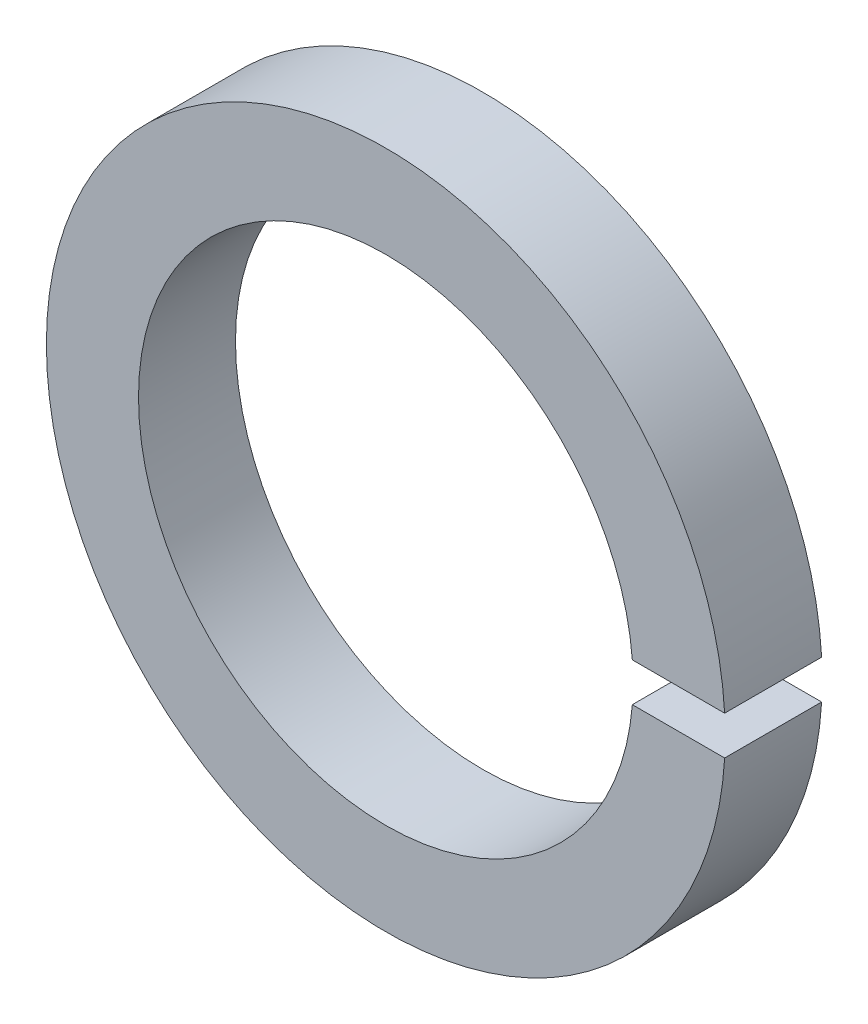
ISO-10303-21;
HEADER;
FILE_DESCRIPTION(('STEP AP214'),'2;1');
FILE_NAME('part.step','',(''),(''),'','','');
FILE_SCHEMA(('AUTOMOTIVE_DESIGN { 1 0 10303 214 1 1 1 1 }'));
ENDSEC;
DATA;
#1=APPLICATION_CONTEXT('core data for automotive mechanical design processes');
#2=APPLICATION_PROTOCOL_DEFINITION('international standard','automotive_design',2000,#1);
#3=PRODUCT_CONTEXT('',#1,'mechanical');
#4=PRODUCT('Part','Part','',(#3));
#5=PRODUCT_RELATED_PRODUCT_CATEGORY('part','',(#4));
#6=PRODUCT_DEFINITION_FORMATION('','',#4);
#7=PRODUCT_DEFINITION_CONTEXT('part definition',#1,'design');
#8=PRODUCT_DEFINITION('design','',#6,#7);
#9=PRODUCT_DEFINITION_SHAPE('','',#8);
#10=(LENGTH_UNIT() NAMED_UNIT(*) SI_UNIT(.MILLI.,.METRE.));
#11=(NAMED_UNIT(*) PLANE_ANGLE_UNIT() SI_UNIT($,.RADIAN.));
#12=(NAMED_UNIT(*) SI_UNIT($,.STERADIAN.) SOLID_ANGLE_UNIT());
#13=UNCERTAINTY_MEASURE_WITH_UNIT(LENGTH_MEASURE(1.E-05),#10,'distance_accuracy_value','');
#14=(GEOMETRIC_REPRESENTATION_CONTEXT(3) GLOBAL_UNCERTAINTY_ASSIGNED_CONTEXT((#13)) GLOBAL_UNIT_ASSIGNED_CONTEXT((#10,
#11,#12)) REPRESENTATION_CONTEXT('',''));
#15=CARTESIAN_POINT('',(0.,0.,0.));
#16=DIRECTION('',(0.,0.,1.));
#17=DIRECTION('',(1.,0.,0.));
#18=AXIS2_PLACEMENT_3D('',#15,#16,#17);
#19=CARTESIAN_POINT('',(0.,0.,0.));
#20=DIRECTION('',(0.,0.,1.));
#21=DIRECTION('',(1.,0.,0.));
#22=AXIS2_PLACEMENT_3D('',#19,#20,#21);
#23=PLANE('',#22);
#24=DIRECTION('',(1.,0.,0.));
#25=VECTOR('',#24,1.);
#26=CARTESIAN_POINT('',(0.,0.2,0.));
#27=LINE('',#26,#25);
#28=CARTESIAN_POINT('',(2.54214476377723,0.2,0.));
#29=VERTEX_POINT('',#28);
#30=CARTESIAN_POINT('',(3.49428104193123,0.2,0.));
#31=VERTEX_POINT('',#30);
#32=EDGE_CURVE('E63',#29,#31,#27,.T.);
#33=ORIENTED_EDGE('',*,*,#32,.F.);
#34=CARTESIAN_POINT('',(0.,0.,0.));
#35=DIRECTION('',(0.,0.,-1.));
#36=DIRECTION('',(-1.,0.,0.));
#37=AXIS2_PLACEMENT_3D('',#34,#35,#36);
#38=CIRCLE('',#37,2.55);
#39=CARTESIAN_POINT('',(2.54214476377723,-0.2,0.));
#40=VERTEX_POINT('',#39);
#41=EDGE_CURVE('E67',#29,#40,#38,.F.);
#42=ORIENTED_EDGE('',*,*,#41,.T.);
#43=DIRECTION('',(1.,0.,0.));
#44=VECTOR('',#43,1.);
#45=CARTESIAN_POINT('',(2.54214476377723,-0.2,0.));
#46=LINE('',#45,#44);
#47=CARTESIAN_POINT('',(3.49428104193123,-0.2,0.));
#48=VERTEX_POINT('',#47);
#49=EDGE_CURVE('E65',#40,#48,#46,.T.);
#50=ORIENTED_EDGE('',*,*,#49,.T.);
#51=CARTESIAN_POINT('',(0.,0.,0.));
#52=DIRECTION('',(0.,0.,-1.));
#53=DIRECTION('',(-1.,0.,0.));
#54=AXIS2_PLACEMENT_3D('',#51,#52,#53);
#55=CIRCLE('',#54,3.5);
#56=EDGE_CURVE('E19',#31,#48,#55,.F.);
#57=ORIENTED_EDGE('',*,*,#56,.F.);
#58=EDGE_LOOP('',(#33,#42,#50,#57));
#59=FACE_BOUND('',#58,.T.);
#60=ADVANCED_FACE('F16',(#59),#23,.F.);
#61=CARTESIAN_POINT('',(0.,0.,1.));
#62=DIRECTION('',(0.,0.,-1.));
#63=DIRECTION('',(-1.,0.,0.));
#64=AXIS2_PLACEMENT_3D('',#61,#62,#63);
#65=CYLINDRICAL_SURFACE('',#64,3.5);
#66=ORIENTED_EDGE('',*,*,#56,.T.);
#67=DIRECTION('',(0.,0.,-1.));
#68=VECTOR('',#67,1.);
#69=CARTESIAN_POINT('',(3.49428104193123,-0.2,1.));
#70=LINE('',#69,#68);
#71=CARTESIAN_POINT('',(3.49428104193123,-0.2,1.));
#72=VERTEX_POINT('',#71);
#73=EDGE_CURVE('E57',#48,#72,#70,.F.);
#74=ORIENTED_EDGE('',*,*,#73,.T.);
#75=CARTESIAN_POINT('',(0.,0.,1.));
#76=DIRECTION('',(0.,0.,-1.));
#77=DIRECTION('',(-1.,0.,0.));
#78=AXIS2_PLACEMENT_3D('',#75,#76,#77);
#79=CIRCLE('',#78,3.5);
#80=CARTESIAN_POINT('',(3.49428104193123,0.2,1.));
#81=VERTEX_POINT('',#80);
#82=EDGE_CURVE('E80',#81,#72,#79,.F.);
#83=ORIENTED_EDGE('',*,*,#82,.F.);
#84=DIRECTION('',(0.,0.,1.));
#85=VECTOR('',#84,1.);
#86=CARTESIAN_POINT('',(3.49428104193123,0.2,1.));
#87=LINE('',#86,#85);
#88=EDGE_CURVE('E60',#81,#31,#87,.F.);
#89=ORIENTED_EDGE('',*,*,#88,.T.);
#90=EDGE_LOOP('',(#66,#74,#83,#89));
#91=FACE_BOUND('',#90,.T.);
#92=ADVANCED_FACE('F55',(#91),#65,.T.);
#93=CARTESIAN_POINT('',(2.54214476377723,-0.2,1.));
#94=DIRECTION('',(0.,-1.,0.));
#95=DIRECTION('',(0.,0.,-1.));
#96=AXIS2_PLACEMENT_3D('',#93,#94,#95);
#97=PLANE('',#96);
#98=DIRECTION('',(0.,0.,-1.));
#99=VECTOR('',#98,1.);
#100=CARTESIAN_POINT('',(2.54214476377723,-0.199999999999999,1.));
#101=LINE('',#100,#99);
#102=CARTESIAN_POINT('',(2.54214476377723,-0.2,1.));
#103=VERTEX_POINT('',#102);
#104=EDGE_CURVE('E70',#40,#103,#101,.F.);
#105=ORIENTED_EDGE('',*,*,#104,.T.);
#106=DIRECTION('',(1.,0.,0.));
#107=VECTOR('',#106,1.);
#108=CARTESIAN_POINT('',(0.,-0.2,1.));
#109=LINE('',#108,#107);
#110=EDGE_CURVE('E73',#72,#103,#109,.F.);
#111=ORIENTED_EDGE('',*,*,#110,.F.);
#112=ORIENTED_EDGE('',*,*,#73,.F.);
#113=ORIENTED_EDGE('',*,*,#49,.F.);
#114=EDGE_LOOP('',(#105,#111,#112,#113));
#115=FACE_BOUND('',#114,.T.);
#116=ADVANCED_FACE('F72',(#115),#97,.F.);
#117=CARTESIAN_POINT('',(0.,0.,1.));
#118=DIRECTION('',(0.,0.,-1.));
#119=DIRECTION('',(-1.,0.,0.));
#120=AXIS2_PLACEMENT_3D('',#117,#118,#119);
#121=CYLINDRICAL_SURFACE('',#120,2.55);
#122=DIRECTION('',(0.,0.,1.));
#123=VECTOR('',#122,1.);
#124=CARTESIAN_POINT('',(2.54214476377723,0.2,1.));
#125=LINE('',#124,#123);
#126=CARTESIAN_POINT('',(2.54214476377723,0.2,1.));
#127=VERTEX_POINT('',#126);
#128=EDGE_CURVE('E81',#29,#127,#125,.T.);
#129=ORIENTED_EDGE('',*,*,#128,.T.);
#130=CARTESIAN_POINT('',(0.,0.,1.));
#131=DIRECTION('',(0.,0.,-1.));
#132=DIRECTION('',(-1.,0.,0.));
#133=AXIS2_PLACEMENT_3D('',#130,#131,#132);
#134=CIRCLE('',#133,2.55);
#135=EDGE_CURVE('E25',#103,#127,#134,.T.);
#136=ORIENTED_EDGE('',*,*,#135,.F.);
#137=ORIENTED_EDGE('',*,*,#104,.F.);
#138=ORIENTED_EDGE('',*,*,#41,.F.);
#139=EDGE_LOOP('',(#129,#136,#137,#138));
#140=FACE_BOUND('',#139,.T.);
#141=ADVANCED_FACE('F84',(#140),#121,.F.);
#142=CARTESIAN_POINT('',(2.54214476377723,0.2,1.));
#143=DIRECTION('',(0.,1.,0.));
#144=DIRECTION('',(0.,0.,1.));
#145=AXIS2_PLACEMENT_3D('',#142,#143,#144);
#146=PLANE('',#145);
#147=ORIENTED_EDGE('',*,*,#88,.F.);
#148=DIRECTION('',(1.,0.,0.));
#149=VECTOR('',#148,1.);
#150=CARTESIAN_POINT('',(0.,0.2,1.));
#151=LINE('',#150,#149);
#152=EDGE_CURVE('E11',#127,#81,#151,.T.);
#153=ORIENTED_EDGE('',*,*,#152,.F.);
#154=ORIENTED_EDGE('',*,*,#128,.F.);
#155=ORIENTED_EDGE('',*,*,#32,.T.);
#156=EDGE_LOOP('',(#147,#153,#154,#155));
#157=FACE_BOUND('',#156,.T.);
#158=ADVANCED_FACE('F90',(#157),#146,.F.);
#159=CARTESIAN_POINT('',(0.,0.,1.));
#160=DIRECTION('',(0.,0.,1.));
#161=DIRECTION('',(1.,0.,0.));
#162=AXIS2_PLACEMENT_3D('',#159,#160,#161);
#163=PLANE('',#162);
#164=ORIENTED_EDGE('',*,*,#135,.T.);
#165=ORIENTED_EDGE('',*,*,#152,.T.);
#166=ORIENTED_EDGE('',*,*,#82,.T.);
#167=ORIENTED_EDGE('',*,*,#110,.T.);
#168=EDGE_LOOP('',(#164,#165,#166,#167));
#169=FACE_BOUND('',#168,.T.);
#170=ADVANCED_FACE('F87',(#169),#163,.T.);
#171=CLOSED_SHELL('',(#60,#92,#116,#141,#158,#170));
#172=MANIFOLD_SOLID_BREP('B1',#171);
#173=ADVANCED_BREP_SHAPE_REPRESENTATION('',(#18,#172),#14);
#174=SHAPE_DEFINITION_REPRESENTATION(#9,#173);
ENDSEC;
END-ISO-10303-21;
